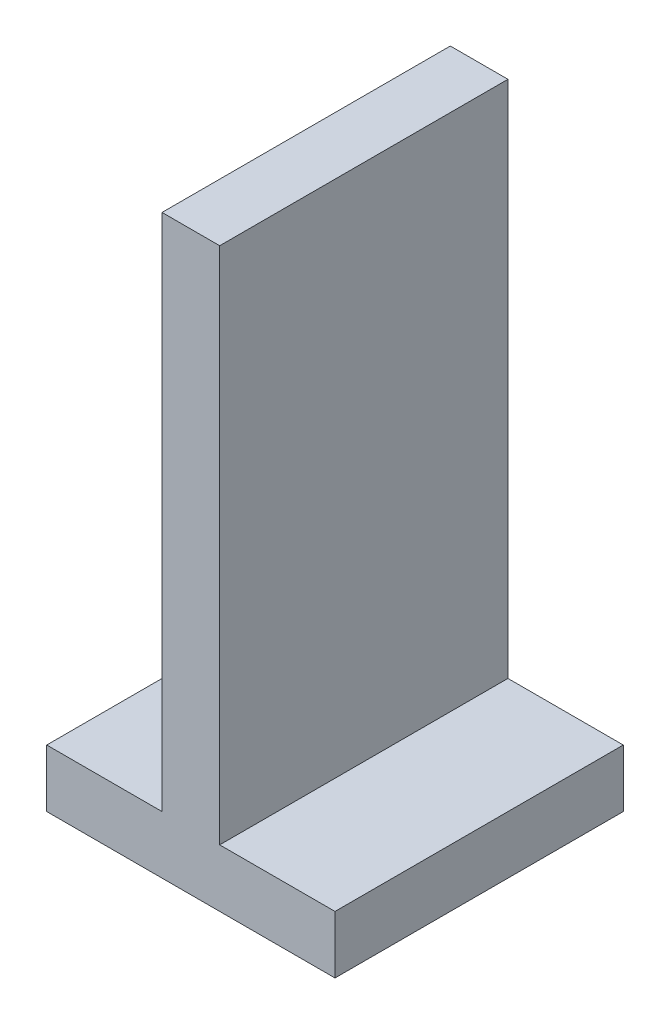
ISO-10303-21;
HEADER;
FILE_DESCRIPTION(('STEP AP214'),'2;1');
FILE_NAME('part.step','',(''),(''),'','','');
FILE_SCHEMA(('AUTOMOTIVE_DESIGN { 1 0 10303 214 1 1 1 1 }'));
ENDSEC;
DATA;
#1=APPLICATION_CONTEXT('core data for automotive mechanical design processes');
#2=APPLICATION_PROTOCOL_DEFINITION('international standard','automotive_design',2000,#1);
#3=PRODUCT_CONTEXT('',#1,'mechanical');
#4=PRODUCT('Part','Part','',(#3));
#5=PRODUCT_RELATED_PRODUCT_CATEGORY('part','',(#4));
#6=PRODUCT_DEFINITION_FORMATION('','',#4);
#7=PRODUCT_DEFINITION_CONTEXT('part definition',#1,'design');
#8=PRODUCT_DEFINITION('design','',#6,#7);
#9=PRODUCT_DEFINITION_SHAPE('','',#8);
#10=(LENGTH_UNIT() NAMED_UNIT(*) SI_UNIT(.MILLI.,.METRE.));
#11=(NAMED_UNIT(*) PLANE_ANGLE_UNIT() SI_UNIT($,.RADIAN.));
#12=(NAMED_UNIT(*) SI_UNIT($,.STERADIAN.) SOLID_ANGLE_UNIT());
#13=UNCERTAINTY_MEASURE_WITH_UNIT(LENGTH_MEASURE(1.E-05),#10,'distance_accuracy_value','');
#14=(GEOMETRIC_REPRESENTATION_CONTEXT(3) GLOBAL_UNCERTAINTY_ASSIGNED_CONTEXT((#13)) GLOBAL_UNIT_ASSIGNED_CONTEXT((#10,
#11,#12)) REPRESENTATION_CONTEXT('',''));
#15=CARTESIAN_POINT('',(0.,0.,0.));
#16=DIRECTION('',(0.,0.,1.));
#17=DIRECTION('',(1.,0.,0.));
#18=AXIS2_PLACEMENT_3D('',#15,#16,#17);
#19=CARTESIAN_POINT('',(200.,1000.,500.));
#20=DIRECTION('',(1.,0.,0.));
#21=DIRECTION('',(0.,1.,0.));
#22=AXIS2_PLACEMENT_3D('',#19,#20,#21);
#23=PLANE('',#22);
#24=DIRECTION('',(0.,-1.,0.));
#25=VECTOR('',#24,1.);
#26=CARTESIAN_POINT('',(200.,700.,420.));
#27=LINE('',#26,#25);
#28=CARTESIAN_POINT('',(200.,700.,420.));
#29=VERTEX_POINT('',#28);
#30=CARTESIAN_POINT('',(200.,100.,420.));
#31=VERTEX_POINT('',#30);
#32=EDGE_CURVE('E235',#29,#31,#27,.T.);
#33=ORIENTED_EDGE('',*,*,#32,.T.);
#34=DIRECTION('',(0.,0.,-1.));
#35=VECTOR('',#34,1.);
#36=CARTESIAN_POINT('',(200.,100.,500.));
#37=LINE('',#36,#35);
#38=CARTESIAN_POINT('',(200.,100.,500.));
#39=VERTEX_POINT('',#38);
#40=EDGE_CURVE('E377',#39,#31,#37,.T.);
#41=ORIENTED_EDGE('',*,*,#40,.F.);
#42=DIRECTION('',(0.,-1.,0.));
#43=VECTOR('',#42,1.);
#44=CARTESIAN_POINT('',(200.,1000.,500.));
#45=LINE('',#44,#43);
#46=CARTESIAN_POINT('',(200.,1000.,500.));
#47=VERTEX_POINT('',#46);
#48=EDGE_CURVE('E342',#47,#39,#45,.T.);
#49=ORIENTED_EDGE('',*,*,#48,.F.);
#50=DIRECTION('',(0.,0.,-1.));
#51=VECTOR('',#50,1.);
#52=CARTESIAN_POINT('',(200.,1000.,500.));
#53=LINE('',#52,#51);
#54=CARTESIAN_POINT('',(200.,1000.,0.));
#55=VERTEX_POINT('',#54);
#56=EDGE_CURVE('E381',#47,#55,#53,.T.);
#57=ORIENTED_EDGE('',*,*,#56,.T.);
#58=DIRECTION('',(0.,-1.,0.));
#59=VECTOR('',#58,1.);
#60=CARTESIAN_POINT('',(200.,1000.,0.));
#61=LINE('',#60,#59);
#62=CARTESIAN_POINT('',(200.,100.,0.));
#63=VERTEX_POINT('',#62);
#64=EDGE_CURVE('E367',#55,#63,#61,.T.);
#65=ORIENTED_EDGE('',*,*,#64,.T.);
#66=CARTESIAN_POINT('',(200.,100.,80.));
#67=VERTEX_POINT('',#66);
#68=EDGE_CURVE('E376',#67,#63,#37,.T.);
#69=ORIENTED_EDGE('',*,*,#68,.F.);
#70=DIRECTION('',(0.,-1.,0.));
#71=VECTOR('',#70,1.);
#72=CARTESIAN_POINT('',(200.,700.,80.));
#73=LINE('',#72,#71);
#74=CARTESIAN_POINT('',(200.,700.,80.));
#75=VERTEX_POINT('',#74);
#76=EDGE_CURVE('E266',#75,#67,#73,.T.);
#77=ORIENTED_EDGE('',*,*,#76,.F.);
#78=DIRECTION('',(0.,0.,-1.));
#79=VECTOR('',#78,1.);
#80=CARTESIAN_POINT('',(200.,700.,80.));
#81=LINE('',#80,#79);
#82=CARTESIAN_POINT('',(200.,700.,130.));
#83=VERTEX_POINT('',#82);
#84=EDGE_CURVE('E263',#83,#75,#81,.T.);
#85=ORIENTED_EDGE('',*,*,#84,.F.);
#86=DIRECTION('',(0.,-1.,0.));
#87=VECTOR('',#86,1.);
#88=CARTESIAN_POINT('',(200.,700.,130.));
#89=LINE('',#88,#87);
#90=CARTESIAN_POINT('',(200.,100.,130.));
#91=VERTEX_POINT('',#90);
#92=EDGE_CURVE('E293',#83,#91,#89,.T.);
#93=ORIENTED_EDGE('',*,*,#92,.T.);
#94=CARTESIAN_POINT('',(200.,100.,370.));
#95=VERTEX_POINT('',#94);
#96=EDGE_CURVE('E382',#95,#91,#37,.T.);
#97=ORIENTED_EDGE('',*,*,#96,.F.);
#98=DIRECTION('',(0.,-1.,0.));
#99=VECTOR('',#98,1.);
#100=CARTESIAN_POINT('',(200.,700.,370.));
#101=LINE('',#100,#99);
#102=CARTESIAN_POINT('',(200.,700.,370.));
#103=VERTEX_POINT('',#102);
#104=EDGE_CURVE('E60',#103,#95,#101,.T.);
#105=ORIENTED_EDGE('',*,*,#104,.F.);
#106=DIRECTION('',(0.,0.,-1.));
#107=VECTOR('',#106,1.);
#108=CARTESIAN_POINT('',(200.,700.,420.));
#109=LINE('',#108,#107);
#110=EDGE_CURVE('E55',#29,#103,#109,.T.);
#111=ORIENTED_EDGE('',*,*,#110,.F.);
#112=EDGE_LOOP('',(#33,#41,#49,#57,#65,#69,#77,#85,#93,#97,#105,#111));
#113=FACE_BOUND('',#112,.T.);
#114=ADVANCED_FACE('F39',(#113),#23,.F.);
#115=CARTESIAN_POINT('',(200.,100.,500.));
#116=DIRECTION('',(0.,-1.,0.));
#117=DIRECTION('',(1.,0.,0.));
#118=AXIS2_PLACEMENT_3D('',#115,#116,#117);
#119=PLANE('',#118);
#120=DIRECTION('',(1.,0.,0.));
#121=VECTOR('',#120,1.);
#122=CARTESIAN_POINT('',(175.,100.,420.));
#123=LINE('',#122,#121);
#124=CARTESIAN_POINT('',(175.,100.,420.));
#125=VERTEX_POINT('',#124);
#126=EDGE_CURVE('E702',#125,#31,#123,.T.);
#127=ORIENTED_EDGE('',*,*,#126,.F.);
#128=DIRECTION('',(0.,0.,1.));
#129=VECTOR('',#128,1.);
#130=CARTESIAN_POINT('',(175.,100.,370.));
#131=LINE('',#130,#129);
#132=CARTESIAN_POINT('',(175.,100.,370.));
#133=VERTEX_POINT('',#132);
#134=EDGE_CURVE('E705',#133,#125,#131,.T.);
#135=ORIENTED_EDGE('',*,*,#134,.F.);
#136=DIRECTION('',(-1.,0.,0.));
#137=VECTOR('',#136,1.);
#138=CARTESIAN_POINT('',(185.,100.,370.));
#139=LINE('',#138,#137);
#140=CARTESIAN_POINT('',(185.,100.,370.));
#141=VERTEX_POINT('',#140);
#142=EDGE_CURVE('E226',#141,#133,#139,.T.);
#143=ORIENTED_EDGE('',*,*,#142,.F.);
#144=DIRECTION('',(0.,0.,-1.));
#145=VECTOR('',#144,1.);
#146=CARTESIAN_POINT('',(185.,100.,400.));
#147=LINE('',#146,#145);
#148=CARTESIAN_POINT('',(185.,100.,400.));
#149=VERTEX_POINT('',#148);
#150=EDGE_CURVE('E223',#149,#141,#147,.T.);
#151=ORIENTED_EDGE('',*,*,#150,.F.);
#152=DIRECTION('',(-1.,0.,0.));
#153=VECTOR('',#152,1.);
#154=CARTESIAN_POINT('',(190.,100.,400.));
#155=LINE('',#154,#153);
#156=CARTESIAN_POINT('',(190.,100.,400.));
#157=VERTEX_POINT('',#156);
#158=EDGE_CURVE('E679',#157,#149,#155,.T.);
#159=ORIENTED_EDGE('',*,*,#158,.F.);
#160=DIRECTION('',(0.,0.,1.));
#161=VECTOR('',#160,1.);
#162=CARTESIAN_POINT('',(190.,100.,370.));
#163=LINE('',#162,#161);
#164=CARTESIAN_POINT('',(190.,100.,370.));
#165=VERTEX_POINT('',#164);
#166=EDGE_CURVE('E710',#165,#157,#163,.T.);
#167=ORIENTED_EDGE('',*,*,#166,.F.);
#168=DIRECTION('',(-1.,0.,0.));
#169=VECTOR('',#168,1.);
#170=CARTESIAN_POINT('',(200.,100.,370.));
#171=LINE('',#170,#169);
#172=EDGE_CURVE('E704',#95,#165,#171,.T.);
#173=ORIENTED_EDGE('',*,*,#172,.F.);
#174=ORIENTED_EDGE('',*,*,#96,.T.);
#175=DIRECTION('',(1.,0.,0.));
#176=VECTOR('',#175,1.);
#177=CARTESIAN_POINT('',(200.,100.,130.));
#178=LINE('',#177,#176);
#179=CARTESIAN_POINT('',(190.,100.,130.));
#180=VERTEX_POINT('',#179);
#181=EDGE_CURVE('E244',#180,#91,#178,.T.);
#182=ORIENTED_EDGE('',*,*,#181,.F.);
#183=DIRECTION('',(0.,0.,1.));
#184=VECTOR('',#183,1.);
#185=CARTESIAN_POINT('',(190.,100.,130.));
#186=LINE('',#185,#184);
#187=CARTESIAN_POINT('',(190.,100.,100.));
#188=VERTEX_POINT('',#187);
#189=EDGE_CURVE('E283',#188,#180,#186,.T.);
#190=ORIENTED_EDGE('',*,*,#189,.F.);
#191=DIRECTION('',(1.,0.,0.));
#192=VECTOR('',#191,1.);
#193=CARTESIAN_POINT('',(190.,100.,100.));
#194=LINE('',#193,#192);
#195=CARTESIAN_POINT('',(185.,100.,100.));
#196=VERTEX_POINT('',#195);
#197=EDGE_CURVE('E279',#196,#188,#194,.T.);
#198=ORIENTED_EDGE('',*,*,#197,.F.);
#199=DIRECTION('',(0.,0.,-1.));
#200=VECTOR('',#199,1.);
#201=CARTESIAN_POINT('',(185.,100.,100.));
#202=LINE('',#201,#200);
#203=CARTESIAN_POINT('',(185.,100.,130.));
#204=VERTEX_POINT('',#203);
#205=EDGE_CURVE('E275',#204,#196,#202,.T.);
#206=ORIENTED_EDGE('',*,*,#205,.F.);
#207=DIRECTION('',(1.,0.,0.));
#208=VECTOR('',#207,1.);
#209=CARTESIAN_POINT('',(185.,100.,130.));
#210=LINE('',#209,#208);
#211=CARTESIAN_POINT('',(175.,100.,130.));
#212=VERTEX_POINT('',#211);
#213=EDGE_CURVE('E271',#212,#204,#210,.T.);
#214=ORIENTED_EDGE('',*,*,#213,.F.);
#215=DIRECTION('',(0.,0.,1.));
#216=VECTOR('',#215,1.);
#217=CARTESIAN_POINT('',(175.,100.,130.));
#218=LINE('',#217,#216);
#219=CARTESIAN_POINT('',(175.,100.,80.));
#220=VERTEX_POINT('',#219);
#221=EDGE_CURVE('E233',#220,#212,#218,.T.);
#222=ORIENTED_EDGE('',*,*,#221,.F.);
#223=DIRECTION('',(-1.,0.,0.));
#224=VECTOR('',#223,1.);
#225=CARTESIAN_POINT('',(175.,100.,80.));
#226=LINE('',#225,#224);
#227=EDGE_CURVE('E228',#67,#220,#226,.T.);
#228=ORIENTED_EDGE('',*,*,#227,.F.);
#229=ORIENTED_EDGE('',*,*,#68,.T.);
#230=DIRECTION('',(-1.,0.,0.));
#231=VECTOR('',#230,1.);
#232=CARTESIAN_POINT('',(200.,100.,0.));
#233=LINE('',#232,#231);
#234=CARTESIAN_POINT('',(0.,100.,0.));
#235=VERTEX_POINT('',#234);
#236=EDGE_CURVE('E327',#63,#235,#233,.T.);
#237=ORIENTED_EDGE('',*,*,#236,.T.);
#238=DIRECTION('',(0.,0.,-1.));
#239=VECTOR('',#238,1.);
#240=CARTESIAN_POINT('',(0.,100.,500.));
#241=LINE('',#240,#239);
#242=CARTESIAN_POINT('',(0.,100.,500.));
#243=VERTEX_POINT('',#242);
#244=EDGE_CURVE('E348',#243,#235,#241,.T.);
#245=ORIENTED_EDGE('',*,*,#244,.F.);
#246=DIRECTION('',(-1.,0.,0.));
#247=VECTOR('',#246,1.);
#248=CARTESIAN_POINT('',(200.,100.,500.));
#249=LINE('',#248,#247);
#250=EDGE_CURVE('E345',#39,#243,#249,.T.);
#251=ORIENTED_EDGE('',*,*,#250,.F.);
#252=ORIENTED_EDGE('',*,*,#40,.T.);
#253=EDGE_LOOP('',(#127,#135,#143,#151,#159,#167,#173,#174,#182,#190,#198,#206,#214,#222,#228,
#229,#237,#245,#251,#252));
#254=FACE_BOUND('',#253,.T.);
#255=ADVANCED_FACE('F432',(#254),#119,.F.);
#256=CARTESIAN_POINT('',(0.,100.,500.));
#257=DIRECTION('',(1.,0.,0.));
#258=DIRECTION('',(0.,1.,0.));
#259=AXIS2_PLACEMENT_3D('',#256,#257,#258);
#260=PLANE('',#259);
#261=DIRECTION('',(0.,-1.,0.));
#262=VECTOR('',#261,1.);
#263=CARTESIAN_POINT('',(0.,100.,0.));
#264=LINE('',#263,#262);
#265=CARTESIAN_POINT('',(0.,0.,0.));
#266=VERTEX_POINT('',#265);
#267=EDGE_CURVE('E321',#235,#266,#264,.T.);
#268=ORIENTED_EDGE('',*,*,#267,.T.);
#269=DIRECTION('',(0.,0.,-1.));
#270=VECTOR('',#269,1.);
#271=CARTESIAN_POINT('',(0.,0.,500.));
#272=LINE('',#271,#270);
#273=CARTESIAN_POINT('',(0.,0.,500.));
#274=VERTEX_POINT('',#273);
#275=EDGE_CURVE('E11',#274,#266,#272,.T.);
#276=ORIENTED_EDGE('',*,*,#275,.F.);
#277=DIRECTION('',(0.,-1.,0.));
#278=VECTOR('',#277,1.);
#279=CARTESIAN_POINT('',(0.,100.,500.));
#280=LINE('',#279,#278);
#281=EDGE_CURVE('E322',#243,#274,#280,.T.);
#282=ORIENTED_EDGE('',*,*,#281,.F.);
#283=ORIENTED_EDGE('',*,*,#244,.T.);
#284=EDGE_LOOP('',(#268,#276,#282,#283));
#285=FACE_BOUND('',#284,.T.);
#286=ADVANCED_FACE('F41',(#285),#260,.F.);
#287=CARTESIAN_POINT('',(0.,0.,500.));
#288=DIRECTION('',(0.,1.,0.));
#289=DIRECTION('',(0.,0.,1.));
#290=AXIS2_PLACEMENT_3D('',#287,#288,#289);
#291=PLANE('',#290);
#292=DIRECTION('',(1.,0.,0.));
#293=VECTOR('',#292,1.);
#294=CARTESIAN_POINT('',(0.,0.,0.));
#295=LINE('',#294,#293);
#296=CARTESIAN_POINT('',(500.,0.,0.));
#297=VERTEX_POINT('',#296);
#298=EDGE_CURVE('E352',#266,#297,#295,.T.);
#299=ORIENTED_EDGE('',*,*,#298,.T.);
#300=DIRECTION('',(0.,0.,-1.));
#301=VECTOR('',#300,1.);
#302=CARTESIAN_POINT('',(500.,0.,500.));
#303=LINE('',#302,#301);
#304=CARTESIAN_POINT('',(500.,0.,500.));
#305=VERTEX_POINT('',#304);
#306=EDGE_CURVE('E48',#305,#297,#303,.T.);
#307=ORIENTED_EDGE('',*,*,#306,.F.);
#308=DIRECTION('',(1.,0.,0.));
#309=VECTOR('',#308,1.);
#310=CARTESIAN_POINT('',(0.,0.,500.));
#311=LINE('',#310,#309);
#312=EDGE_CURVE('E326',#274,#305,#311,.T.);
#313=ORIENTED_EDGE('',*,*,#312,.F.);
#314=ORIENTED_EDGE('',*,*,#275,.T.);
#315=EDGE_LOOP('',(#299,#307,#313,#314));
#316=FACE_BOUND('',#315,.T.);
#317=ADVANCED_FACE('F426',(#316),#291,.F.);
#318=CARTESIAN_POINT('',(500.,0.,500.));
#319=DIRECTION('',(-1.,0.,0.));
#320=DIRECTION('',(0.,0.,1.));
#321=AXIS2_PLACEMENT_3D('',#318,#319,#320);
#322=PLANE('',#321);
#323=DIRECTION('',(0.,1.,0.));
#324=VECTOR('',#323,1.);
#325=CARTESIAN_POINT('',(500.,0.,0.));
#326=LINE('',#325,#324);
#327=CARTESIAN_POINT('',(500.,100.,0.));
#328=VERTEX_POINT('',#327);
#329=EDGE_CURVE('E355',#297,#328,#326,.T.);
#330=ORIENTED_EDGE('',*,*,#329,.T.);
#331=DIRECTION('',(0.,0.,-1.));
#332=VECTOR('',#331,1.);
#333=CARTESIAN_POINT('',(500.,100.,500.));
#334=LINE('',#333,#332);
#335=CARTESIAN_POINT('',(500.,100.,500.));
#336=VERTEX_POINT('',#335);
#337=EDGE_CURVE('E394',#336,#328,#334,.T.);
#338=ORIENTED_EDGE('',*,*,#337,.F.);
#339=DIRECTION('',(0.,1.,0.));
#340=VECTOR('',#339,1.);
#341=CARTESIAN_POINT('',(500.,0.,500.));
#342=LINE('',#341,#340);
#343=EDGE_CURVE('E330',#305,#336,#342,.T.);
#344=ORIENTED_EDGE('',*,*,#343,.F.);
#345=ORIENTED_EDGE('',*,*,#306,.T.);
#346=EDGE_LOOP('',(#330,#338,#344,#345));
#347=FACE_BOUND('',#346,.T.);
#348=ADVANCED_FACE('F403',(#347),#322,.F.);
#349=CARTESIAN_POINT('',(500.,100.,500.));
#350=DIRECTION('',(0.,-1.,0.));
#351=DIRECTION('',(1.,0.,0.));
#352=AXIS2_PLACEMENT_3D('',#349,#350,#351);
#353=PLANE('',#352);
#354=DIRECTION('',(-1.,0.,0.));
#355=VECTOR('',#354,1.);
#356=CARTESIAN_POINT('',(500.,100.,0.));
#357=LINE('',#356,#355);
#358=CARTESIAN_POINT('',(300.,100.,0.));
#359=VERTEX_POINT('',#358);
#360=EDGE_CURVE('E358',#328,#359,#357,.T.);
#361=ORIENTED_EDGE('',*,*,#360,.T.);
#362=DIRECTION('',(0.,0.,-1.));
#363=VECTOR('',#362,1.);
#364=CARTESIAN_POINT('',(300.,100.,500.));
#365=LINE('',#364,#363);
#366=CARTESIAN_POINT('',(300.,100.,500.));
#367=VERTEX_POINT('',#366);
#368=EDGE_CURVE('E390',#367,#359,#365,.T.);
#369=ORIENTED_EDGE('',*,*,#368,.F.);
#370=DIRECTION('',(-1.,0.,0.));
#371=VECTOR('',#370,1.);
#372=CARTESIAN_POINT('',(500.,100.,500.));
#373=LINE('',#372,#371);
#374=EDGE_CURVE('E333',#336,#367,#373,.T.);
#375=ORIENTED_EDGE('',*,*,#374,.F.);
#376=ORIENTED_EDGE('',*,*,#337,.T.);
#377=EDGE_LOOP('',(#361,#369,#375,#376));
#378=FACE_BOUND('',#377,.T.);
#379=ADVANCED_FACE('F414',(#378),#353,.F.);
#380=CARTESIAN_POINT('',(300.,100.,500.));
#381=DIRECTION('',(-1.,0.,0.));
#382=DIRECTION('',(0.,0.,1.));
#383=AXIS2_PLACEMENT_3D('',#380,#381,#382);
#384=PLANE('',#383);
#385=DIRECTION('',(0.,1.,0.));
#386=VECTOR('',#385,1.);
#387=CARTESIAN_POINT('',(300.,100.,0.));
#388=LINE('',#387,#386);
#389=CARTESIAN_POINT('',(300.,1000.,0.));
#390=VERTEX_POINT('',#389);
#391=EDGE_CURVE('E361',#359,#390,#388,.T.);
#392=ORIENTED_EDGE('',*,*,#391,.T.);
#393=DIRECTION('',(0.,0.,-1.));
#394=VECTOR('',#393,1.);
#395=CARTESIAN_POINT('',(300.,1000.,500.));
#396=LINE('',#395,#394);
#397=CARTESIAN_POINT('',(300.,1000.,500.));
#398=VERTEX_POINT('',#397);
#399=EDGE_CURVE('E386',#398,#390,#396,.T.);
#400=ORIENTED_EDGE('',*,*,#399,.F.);
#401=DIRECTION('',(0.,1.,0.));
#402=VECTOR('',#401,1.);
#403=CARTESIAN_POINT('',(300.,100.,500.));
#404=LINE('',#403,#402);
#405=EDGE_CURVE('E336',#367,#398,#404,.T.);
#406=ORIENTED_EDGE('',*,*,#405,.F.);
#407=ORIENTED_EDGE('',*,*,#368,.T.);
#408=EDGE_LOOP('',(#392,#400,#406,#407));
#409=FACE_BOUND('',#408,.T.);
#410=ADVANCED_FACE('F418',(#409),#384,.F.);
#411=CARTESIAN_POINT('',(300.,1000.,500.));
#412=DIRECTION('',(0.,-1.,0.));
#413=DIRECTION('',(0.,0.,-1.));
#414=AXIS2_PLACEMENT_3D('',#411,#412,#413);
#415=PLANE('',#414);
#416=DIRECTION('',(-1.,0.,0.));
#417=VECTOR('',#416,1.);
#418=CARTESIAN_POINT('',(300.,1000.,0.));
#419=LINE('',#418,#417);
#420=EDGE_CURVE('E364',#390,#55,#419,.T.);
#421=ORIENTED_EDGE('',*,*,#420,.T.);
#422=ORIENTED_EDGE('',*,*,#56,.F.);
#423=DIRECTION('',(-1.,0.,0.));
#424=VECTOR('',#423,1.);
#425=CARTESIAN_POINT('',(300.,1000.,500.));
#426=LINE('',#425,#424);
#427=EDGE_CURVE('E339',#398,#47,#426,.T.);
#428=ORIENTED_EDGE('',*,*,#427,.F.);
#429=ORIENTED_EDGE('',*,*,#399,.T.);
#430=EDGE_LOOP('',(#421,#422,#428,#429));
#431=FACE_BOUND('',#430,.T.);
#432=ADVANCED_FACE('F439',(#431),#415,.F.);
#433=CARTESIAN_POINT('',(0.,0.,500.));
#434=DIRECTION('',(0.,0.,1.));
#435=DIRECTION('',(1.,0.,0.));
#436=AXIS2_PLACEMENT_3D('',#433,#434,#435);
#437=PLANE('',#436);
#438=ORIENTED_EDGE('',*,*,#281,.T.);
#439=ORIENTED_EDGE('',*,*,#312,.T.);
#440=ORIENTED_EDGE('',*,*,#343,.T.);
#441=ORIENTED_EDGE('',*,*,#374,.T.);
#442=ORIENTED_EDGE('',*,*,#405,.T.);
#443=ORIENTED_EDGE('',*,*,#427,.T.);
#444=ORIENTED_EDGE('',*,*,#48,.T.);
#445=ORIENTED_EDGE('',*,*,#250,.T.);
#446=EDGE_LOOP('',(#438,#439,#440,#441,#442,#443,#444,#445));
#447=FACE_BOUND('',#446,.T.);
#448=ADVANCED_FACE('F422',(#447),#437,.T.);
#449=CARTESIAN_POINT('',(0.,0.,0.));
#450=DIRECTION('',(0.,0.,1.));
#451=DIRECTION('',(1.,0.,0.));
#452=AXIS2_PLACEMENT_3D('',#449,#450,#451);
#453=PLANE('',#452);
#454=ORIENTED_EDGE('',*,*,#267,.F.);
#455=ORIENTED_EDGE('',*,*,#236,.F.);
#456=ORIENTED_EDGE('',*,*,#64,.F.);
#457=ORIENTED_EDGE('',*,*,#420,.F.);
#458=ORIENTED_EDGE('',*,*,#391,.F.);
#459=ORIENTED_EDGE('',*,*,#360,.F.);
#460=ORIENTED_EDGE('',*,*,#329,.F.);
#461=ORIENTED_EDGE('',*,*,#298,.F.);
#462=EDGE_LOOP('',(#454,#455,#456,#457,#458,#459,#460,#461));
#463=FACE_BOUND('',#462,.T.);
#464=ADVANCED_FACE('F409',(#463),#453,.F.);
#465=CARTESIAN_POINT('',(175.,700.,80.));
#466=DIRECTION('',(0.,0.,1.));
#467=DIRECTION('',(1.,0.,0.));
#468=AXIS2_PLACEMENT_3D('',#465,#466,#467);
#469=PLANE('',#468);
#470=ORIENTED_EDGE('',*,*,#227,.T.);
#471=DIRECTION('',(0.,-1.,0.));
#472=VECTOR('',#471,1.);
#473=CARTESIAN_POINT('',(175.,700.,80.));
#474=LINE('',#473,#472);
#475=CARTESIAN_POINT('',(175.,700.,80.));
#476=VERTEX_POINT('',#475);
#477=EDGE_CURVE('E317',#476,#220,#474,.T.);
#478=ORIENTED_EDGE('',*,*,#477,.F.);
#479=DIRECTION('',(-1.,0.,0.));
#480=VECTOR('',#479,1.);
#481=CARTESIAN_POINT('',(175.,700.,80.));
#482=LINE('',#481,#480);
#483=EDGE_CURVE('E239',#75,#476,#482,.T.);
#484=ORIENTED_EDGE('',*,*,#483,.F.);
#485=ORIENTED_EDGE('',*,*,#76,.T.);
#486=EDGE_LOOP('',(#470,#478,#484,#485));
#487=FACE_BOUND('',#486,.T.);
#488=ADVANCED_FACE('F457',(#487),#469,.F.);
#489=CARTESIAN_POINT('',(175.,700.,130.));
#490=DIRECTION('',(1.,0.,0.));
#491=DIRECTION('',(0.,1.,0.));
#492=AXIS2_PLACEMENT_3D('',#489,#490,#491);
#493=PLANE('',#492);
#494=ORIENTED_EDGE('',*,*,#221,.T.);
#495=DIRECTION('',(0.,-1.,0.));
#496=VECTOR('',#495,1.);
#497=CARTESIAN_POINT('',(175.,700.,130.));
#498=LINE('',#497,#496);
#499=CARTESIAN_POINT('',(175.,700.,130.));
#500=VERTEX_POINT('',#499);
#501=EDGE_CURVE('E313',#500,#212,#498,.T.);
#502=ORIENTED_EDGE('',*,*,#501,.F.);
#503=DIRECTION('',(0.,0.,1.));
#504=VECTOR('',#503,1.);
#505=CARTESIAN_POINT('',(175.,700.,130.));
#506=LINE('',#505,#504);
#507=EDGE_CURVE('E243',#476,#500,#506,.T.);
#508=ORIENTED_EDGE('',*,*,#507,.F.);
#509=ORIENTED_EDGE('',*,*,#477,.T.);
#510=EDGE_LOOP('',(#494,#502,#508,#509));
#511=FACE_BOUND('',#510,.T.);
#512=ADVANCED_FACE('F461',(#511),#493,.F.);
#513=CARTESIAN_POINT('',(185.,700.,130.));
#514=DIRECTION('',(0.,0.,-1.));
#515=DIRECTION('',(-1.,0.,0.));
#516=AXIS2_PLACEMENT_3D('',#513,#514,#515);
#517=PLANE('',#516);
#518=ORIENTED_EDGE('',*,*,#213,.T.);
#519=DIRECTION('',(0.,-1.,0.));
#520=VECTOR('',#519,1.);
#521=CARTESIAN_POINT('',(185.,700.,130.));
#522=LINE('',#521,#520);
#523=CARTESIAN_POINT('',(185.,700.,130.));
#524=VERTEX_POINT('',#523);
#525=EDGE_CURVE('E309',#524,#204,#522,.T.);
#526=ORIENTED_EDGE('',*,*,#525,.F.);
#527=DIRECTION('',(1.,0.,0.));
#528=VECTOR('',#527,1.);
#529=CARTESIAN_POINT('',(185.,700.,130.));
#530=LINE('',#529,#528);
#531=EDGE_CURVE('E247',#500,#524,#530,.T.);
#532=ORIENTED_EDGE('',*,*,#531,.F.);
#533=ORIENTED_EDGE('',*,*,#501,.T.);
#534=EDGE_LOOP('',(#518,#526,#532,#533));
#535=FACE_BOUND('',#534,.T.);
#536=ADVANCED_FACE('F465',(#535),#517,.F.);
#537=CARTESIAN_POINT('',(185.,700.,100.));
#538=DIRECTION('',(-1.,0.,0.));
#539=DIRECTION('',(0.,0.,1.));
#540=AXIS2_PLACEMENT_3D('',#537,#538,#539);
#541=PLANE('',#540);
#542=ORIENTED_EDGE('',*,*,#205,.T.);
#543=DIRECTION('',(0.,-1.,0.));
#544=VECTOR('',#543,1.);
#545=CARTESIAN_POINT('',(185.,700.,100.));
#546=LINE('',#545,#544);
#547=CARTESIAN_POINT('',(185.,700.,100.));
#548=VERTEX_POINT('',#547);
#549=EDGE_CURVE('E305',#548,#196,#546,.T.);
#550=ORIENTED_EDGE('',*,*,#549,.F.);
#551=DIRECTION('',(0.,0.,-1.));
#552=VECTOR('',#551,1.);
#553=CARTESIAN_POINT('',(185.,700.,100.));
#554=LINE('',#553,#552);
#555=EDGE_CURVE('E250',#524,#548,#554,.T.);
#556=ORIENTED_EDGE('',*,*,#555,.F.);
#557=ORIENTED_EDGE('',*,*,#525,.T.);
#558=EDGE_LOOP('',(#542,#550,#556,#557));
#559=FACE_BOUND('',#558,.T.);
#560=ADVANCED_FACE('F469',(#559),#541,.F.);
#561=CARTESIAN_POINT('',(190.,700.,100.));
#562=DIRECTION('',(0.,0.,-1.));
#563=DIRECTION('',(-1.,0.,0.));
#564=AXIS2_PLACEMENT_3D('',#561,#562,#563);
#565=PLANE('',#564);
#566=ORIENTED_EDGE('',*,*,#197,.T.);
#567=DIRECTION('',(0.,-1.,0.));
#568=VECTOR('',#567,1.);
#569=CARTESIAN_POINT('',(190.,700.,100.));
#570=LINE('',#569,#568);
#571=CARTESIAN_POINT('',(190.,700.,100.));
#572=VERTEX_POINT('',#571);
#573=EDGE_CURVE('E301',#572,#188,#570,.T.);
#574=ORIENTED_EDGE('',*,*,#573,.F.);
#575=DIRECTION('',(1.,0.,0.));
#576=VECTOR('',#575,1.);
#577=CARTESIAN_POINT('',(190.,700.,100.));
#578=LINE('',#577,#576);
#579=EDGE_CURVE('E253',#548,#572,#578,.T.);
#580=ORIENTED_EDGE('',*,*,#579,.F.);
#581=ORIENTED_EDGE('',*,*,#549,.T.);
#582=EDGE_LOOP('',(#566,#574,#580,#581));
#583=FACE_BOUND('',#582,.T.);
#584=ADVANCED_FACE('F473',(#583),#565,.F.);
#585=CARTESIAN_POINT('',(190.,700.,130.));
#586=DIRECTION('',(1.,0.,0.));
#587=DIRECTION('',(0.,1.,0.));
#588=AXIS2_PLACEMENT_3D('',#585,#586,#587);
#589=PLANE('',#588);
#590=ORIENTED_EDGE('',*,*,#189,.T.);
#591=DIRECTION('',(0.,-1.,0.));
#592=VECTOR('',#591,1.);
#593=CARTESIAN_POINT('',(190.,700.,130.));
#594=LINE('',#593,#592);
#595=CARTESIAN_POINT('',(190.,700.,130.));
#596=VERTEX_POINT('',#595);
#597=EDGE_CURVE('E297',#596,#180,#594,.T.);
#598=ORIENTED_EDGE('',*,*,#597,.F.);
#599=DIRECTION('',(0.,0.,1.));
#600=VECTOR('',#599,1.);
#601=CARTESIAN_POINT('',(190.,700.,130.));
#602=LINE('',#601,#600);
#603=EDGE_CURVE('E256',#572,#596,#602,.T.);
#604=ORIENTED_EDGE('',*,*,#603,.F.);
#605=ORIENTED_EDGE('',*,*,#573,.T.);
#606=EDGE_LOOP('',(#590,#598,#604,#605));
#607=FACE_BOUND('',#606,.T.);
#608=ADVANCED_FACE('F477',(#607),#589,.F.);
#609=CARTESIAN_POINT('',(200.,700.,130.));
#610=DIRECTION('',(0.,0.,-1.));
#611=DIRECTION('',(-1.,0.,0.));
#612=AXIS2_PLACEMENT_3D('',#609,#610,#611);
#613=PLANE('',#612);
#614=ORIENTED_EDGE('',*,*,#181,.T.);
#615=ORIENTED_EDGE('',*,*,#92,.F.);
#616=DIRECTION('',(1.,0.,0.));
#617=VECTOR('',#616,1.);
#618=CARTESIAN_POINT('',(200.,700.,130.));
#619=LINE('',#618,#617);
#620=EDGE_CURVE('E259',#596,#83,#619,.T.);
#621=ORIENTED_EDGE('',*,*,#620,.F.);
#622=ORIENTED_EDGE('',*,*,#597,.T.);
#623=EDGE_LOOP('',(#614,#615,#621,#622));
#624=FACE_BOUND('',#623,.T.);
#625=ADVANCED_FACE('F481',(#624),#613,.F.);
#626=CARTESIAN_POINT('',(0.,700.,0.));
#627=DIRECTION('',(0.,-1.,0.));
#628=DIRECTION('',(0.,0.,-1.));
#629=AXIS2_PLACEMENT_3D('',#626,#627,#628);
#630=PLANE('',#629);
#631=ORIENTED_EDGE('',*,*,#483,.T.);
#632=ORIENTED_EDGE('',*,*,#507,.T.);
#633=ORIENTED_EDGE('',*,*,#531,.T.);
#634=ORIENTED_EDGE('',*,*,#555,.T.);
#635=ORIENTED_EDGE('',*,*,#579,.T.);
#636=ORIENTED_EDGE('',*,*,#603,.T.);
#637=ORIENTED_EDGE('',*,*,#620,.T.);
#638=ORIENTED_EDGE('',*,*,#84,.T.);
#639=EDGE_LOOP('',(#631,#632,#633,#634,#635,#636,#637,#638));
#640=FACE_BOUND('',#639,.T.);
#641=ADVANCED_FACE('F485',(#640),#630,.F.);
#642=CARTESIAN_POINT('',(185.,700.,370.));
#643=DIRECTION('',(0.,0.,1.));
#644=DIRECTION('',(1.,0.,0.));
#645=AXIS2_PLACEMENT_3D('',#642,#643,#644);
#646=PLANE('',#645);
#647=ORIENTED_EDGE('',*,*,#142,.T.);
#648=DIRECTION('',(0.,-1.,0.));
#649=VECTOR('',#648,1.);
#650=CARTESIAN_POINT('',(175.,700.,370.));
#651=LINE('',#650,#649);
#652=CARTESIAN_POINT('',(175.,700.,370.));
#653=VERTEX_POINT('',#652);
#654=EDGE_CURVE('E205',#653,#133,#651,.T.);
#655=ORIENTED_EDGE('',*,*,#654,.F.);
#656=DIRECTION('',(-1.,0.,0.));
#657=VECTOR('',#656,1.);
#658=CARTESIAN_POINT('',(185.,700.,370.));
#659=LINE('',#658,#657);
#660=CARTESIAN_POINT('',(185.,700.,370.));
#661=VERTEX_POINT('',#660);
#662=EDGE_CURVE('E213',#661,#653,#659,.T.);
#663=ORIENTED_EDGE('',*,*,#662,.F.);
#664=DIRECTION('',(0.,-1.,0.));
#665=VECTOR('',#664,1.);
#666=CARTESIAN_POINT('',(185.,700.,370.));
#667=LINE('',#666,#665);
#668=EDGE_CURVE('E674',#661,#141,#667,.T.);
#669=ORIENTED_EDGE('',*,*,#668,.T.);
#670=EDGE_LOOP('',(#647,#655,#663,#669));
#671=FACE_BOUND('',#670,.T.);
#672=ADVANCED_FACE('F225',(#671),#646,.F.);
#673=CARTESIAN_POINT('',(175.,700.,370.));
#674=DIRECTION('',(1.,0.,0.));
#675=DIRECTION('',(0.,0.,-1.));
#676=AXIS2_PLACEMENT_3D('',#673,#674,#675);
#677=PLANE('',#676);
#678=ORIENTED_EDGE('',*,*,#134,.T.);
#679=DIRECTION('',(0.,-1.,0.));
#680=VECTOR('',#679,1.);
#681=CARTESIAN_POINT('',(175.,700.,420.));
#682=LINE('',#681,#680);
#683=CARTESIAN_POINT('',(175.,700.,420.));
#684=VERTEX_POINT('',#683);
#685=EDGE_CURVE('E208',#684,#125,#682,.T.);
#686=ORIENTED_EDGE('',*,*,#685,.F.);
#687=DIRECTION('',(0.,0.,1.));
#688=VECTOR('',#687,1.);
#689=CARTESIAN_POINT('',(175.,700.,370.));
#690=LINE('',#689,#688);
#691=EDGE_CURVE('E200',#653,#684,#690,.T.);
#692=ORIENTED_EDGE('',*,*,#691,.F.);
#693=ORIENTED_EDGE('',*,*,#654,.T.);
#694=EDGE_LOOP('',(#678,#686,#692,#693));
#695=FACE_BOUND('',#694,.T.);
#696=ADVANCED_FACE('F203',(#695),#677,.F.);
#697=CARTESIAN_POINT('',(175.,700.,420.));
#698=DIRECTION('',(0.,0.,-1.));
#699=DIRECTION('',(-1.,0.,0.));
#700=AXIS2_PLACEMENT_3D('',#697,#698,#699);
#701=PLANE('',#700);
#702=ORIENTED_EDGE('',*,*,#126,.T.);
#703=ORIENTED_EDGE('',*,*,#32,.F.);
#704=DIRECTION('',(1.,0.,0.));
#705=VECTOR('',#704,1.);
#706=CARTESIAN_POINT('',(175.,700.,420.));
#707=LINE('',#706,#705);
#708=EDGE_CURVE('E212',#684,#29,#707,.T.);
#709=ORIENTED_EDGE('',*,*,#708,.F.);
#710=ORIENTED_EDGE('',*,*,#685,.T.);
#711=EDGE_LOOP('',(#702,#703,#709,#710));
#712=FACE_BOUND('',#711,.T.);
#713=ADVANCED_FACE('F494',(#712),#701,.F.);
#714=CARTESIAN_POINT('',(200.,700.,370.));
#715=DIRECTION('',(0.,0.,1.));
#716=DIRECTION('',(1.,0.,0.));
#717=AXIS2_PLACEMENT_3D('',#714,#715,#716);
#718=PLANE('',#717);
#719=ORIENTED_EDGE('',*,*,#172,.T.);
#720=DIRECTION('',(0.,-1.,0.));
#721=VECTOR('',#720,1.);
#722=CARTESIAN_POINT('',(190.,700.,370.));
#723=LINE('',#722,#721);
#724=CARTESIAN_POINT('',(190.,700.,370.));
#725=VERTEX_POINT('',#724);
#726=EDGE_CURVE('E694',#725,#165,#723,.T.);
#727=ORIENTED_EDGE('',*,*,#726,.F.);
#728=DIRECTION('',(-1.,0.,0.));
#729=VECTOR('',#728,1.);
#730=CARTESIAN_POINT('',(200.,700.,370.));
#731=LINE('',#730,#729);
#732=EDGE_CURVE('E724',#103,#725,#731,.T.);
#733=ORIENTED_EDGE('',*,*,#732,.F.);
#734=ORIENTED_EDGE('',*,*,#104,.T.);
#735=EDGE_LOOP('',(#719,#727,#733,#734));
#736=FACE_BOUND('',#735,.T.);
#737=ADVANCED_FACE('F497',(#736),#718,.F.);
#738=CARTESIAN_POINT('',(190.,700.,370.));
#739=DIRECTION('',(1.,0.,0.));
#740=DIRECTION('',(0.,1.,0.));
#741=AXIS2_PLACEMENT_3D('',#738,#739,#740);
#742=PLANE('',#741);
#743=ORIENTED_EDGE('',*,*,#166,.T.);
#744=DIRECTION('',(0.,-1.,0.));
#745=VECTOR('',#744,1.);
#746=CARTESIAN_POINT('',(190.,700.,400.));
#747=LINE('',#746,#745);
#748=CARTESIAN_POINT('',(190.,700.,400.));
#749=VERTEX_POINT('',#748);
#750=EDGE_CURVE('E685',#749,#157,#747,.T.);
#751=ORIENTED_EDGE('',*,*,#750,.F.);
#752=DIRECTION('',(0.,0.,1.));
#753=VECTOR('',#752,1.);
#754=CARTESIAN_POINT('',(190.,700.,370.));
#755=LINE('',#754,#753);
#756=EDGE_CURVE('E722',#725,#749,#755,.T.);
#757=ORIENTED_EDGE('',*,*,#756,.F.);
#758=ORIENTED_EDGE('',*,*,#726,.T.);
#759=EDGE_LOOP('',(#743,#751,#757,#758));
#760=FACE_BOUND('',#759,.T.);
#761=ADVANCED_FACE('F501',(#760),#742,.F.);
#762=CARTESIAN_POINT('',(190.,700.,400.));
#763=DIRECTION('',(0.,0.,1.));
#764=DIRECTION('',(1.,0.,0.));
#765=AXIS2_PLACEMENT_3D('',#762,#763,#764);
#766=PLANE('',#765);
#767=ORIENTED_EDGE('',*,*,#158,.T.);
#768=DIRECTION('',(0.,-1.,0.));
#769=VECTOR('',#768,1.);
#770=CARTESIAN_POINT('',(185.,700.,400.));
#771=LINE('',#770,#769);
#772=CARTESIAN_POINT('',(185.,700.,400.));
#773=VERTEX_POINT('',#772);
#774=EDGE_CURVE('E676',#773,#149,#771,.T.);
#775=ORIENTED_EDGE('',*,*,#774,.F.);
#776=DIRECTION('',(-1.,0.,0.));
#777=VECTOR('',#776,1.);
#778=CARTESIAN_POINT('',(190.,700.,400.));
#779=LINE('',#778,#777);
#780=EDGE_CURVE('E687',#749,#773,#779,.T.);
#781=ORIENTED_EDGE('',*,*,#780,.F.);
#782=ORIENTED_EDGE('',*,*,#750,.T.);
#783=EDGE_LOOP('',(#767,#775,#781,#782));
#784=FACE_BOUND('',#783,.T.);
#785=ADVANCED_FACE('F505',(#784),#766,.F.);
#786=CARTESIAN_POINT('',(185.,700.,400.));
#787=DIRECTION('',(-1.,0.,0.));
#788=DIRECTION('',(0.,-1.,0.));
#789=AXIS2_PLACEMENT_3D('',#786,#787,#788);
#790=PLANE('',#789);
#791=ORIENTED_EDGE('',*,*,#150,.T.);
#792=ORIENTED_EDGE('',*,*,#668,.F.);
#793=DIRECTION('',(0.,0.,-1.));
#794=VECTOR('',#793,1.);
#795=CARTESIAN_POINT('',(185.,700.,400.));
#796=LINE('',#795,#794);
#797=EDGE_CURVE('E218',#773,#661,#796,.T.);
#798=ORIENTED_EDGE('',*,*,#797,.F.);
#799=ORIENTED_EDGE('',*,*,#774,.T.);
#800=EDGE_LOOP('',(#791,#792,#798,#799));
#801=FACE_BOUND('',#800,.T.);
#802=ADVANCED_FACE('F509',(#801),#790,.F.);
#803=CARTESIAN_POINT('',(0.,700.,0.));
#804=DIRECTION('',(0.,1.,0.));
#805=DIRECTION('',(0.,0.,1.));
#806=AXIS2_PLACEMENT_3D('',#803,#804,#805);
#807=PLANE('',#806);
#808=ORIENTED_EDGE('',*,*,#662,.T.);
#809=ORIENTED_EDGE('',*,*,#691,.T.);
#810=ORIENTED_EDGE('',*,*,#708,.T.);
#811=ORIENTED_EDGE('',*,*,#110,.T.);
#812=ORIENTED_EDGE('',*,*,#732,.T.);
#813=ORIENTED_EDGE('',*,*,#756,.T.);
#814=ORIENTED_EDGE('',*,*,#780,.T.);
#815=ORIENTED_EDGE('',*,*,#797,.T.);
#816=EDGE_LOOP('',(#808,#809,#810,#811,#812,#813,#814,#815));
#817=FACE_BOUND('',#816,.T.);
#818=ADVANCED_FACE('F216',(#817),#807,.T.);
#819=CLOSED_SHELL('',(#114,#255,#286,#317,#348,#379,#410,#432,#448,#464,#488,#512,#536,#560,
#584,#608,#625,#641,#672,#696,#713,#737,#761,#785,#802,#818));
#820=MANIFOLD_SOLID_BREP('B2',#819);
#821=ADVANCED_BREP_SHAPE_REPRESENTATION('',(#18,#820),#14);
#822=SHAPE_DEFINITION_REPRESENTATION(#9,#821);
ENDSEC;
END-ISO-10303-21;
